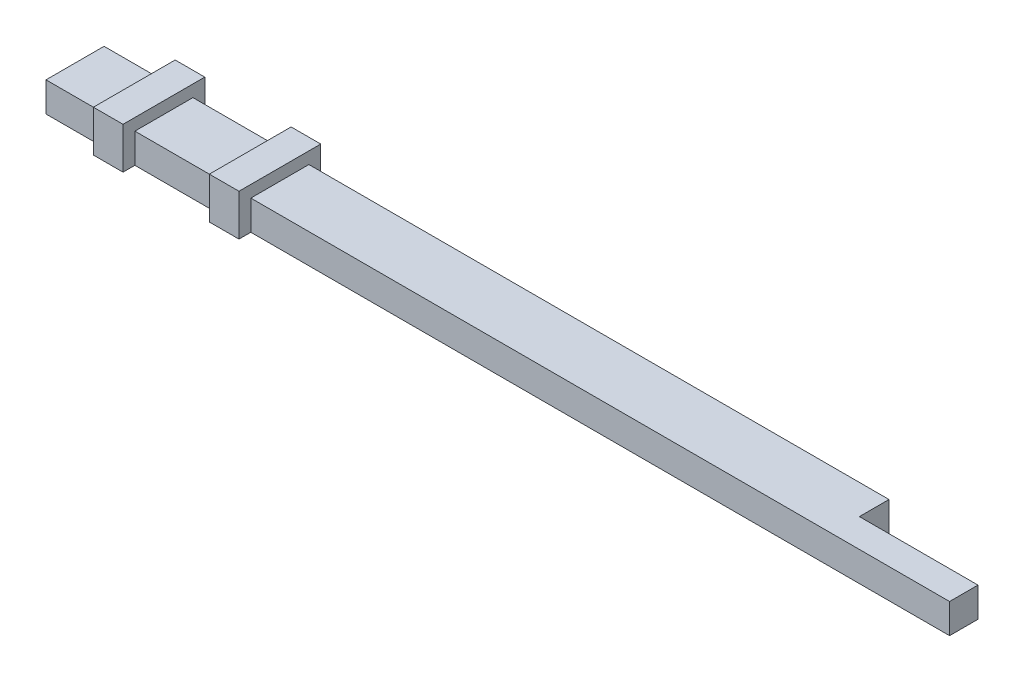
ISO-10303-21;
HEADER;
FILE_DESCRIPTION(('STEP AP214'),'2;1');
FILE_NAME('part.step','',(''),(''),'','','');
FILE_SCHEMA(('AUTOMOTIVE_DESIGN { 1 0 10303 214 1 1 1 1 }'));
ENDSEC;
DATA;
#1=APPLICATION_CONTEXT('core data for automotive mechanical design processes');
#2=APPLICATION_PROTOCOL_DEFINITION('international standard','automotive_design',2000,#1);
#3=PRODUCT_CONTEXT('',#1,'mechanical');
#4=PRODUCT('Part','Part','',(#3));
#5=PRODUCT_RELATED_PRODUCT_CATEGORY('part','',(#4));
#6=PRODUCT_DEFINITION_FORMATION('','',#4);
#7=PRODUCT_DEFINITION_CONTEXT('part definition',#1,'design');
#8=PRODUCT_DEFINITION('design','',#6,#7);
#9=PRODUCT_DEFINITION_SHAPE('','',#8);
#10=(LENGTH_UNIT() NAMED_UNIT(*) SI_UNIT(.MILLI.,.METRE.));
#11=(NAMED_UNIT(*) PLANE_ANGLE_UNIT() SI_UNIT($,.RADIAN.));
#12=(NAMED_UNIT(*) SI_UNIT($,.STERADIAN.) SOLID_ANGLE_UNIT());
#13=UNCERTAINTY_MEASURE_WITH_UNIT(LENGTH_MEASURE(1.E-05),#10,'distance_accuracy_value','');
#14=(GEOMETRIC_REPRESENTATION_CONTEXT(3) GLOBAL_UNCERTAINTY_ASSIGNED_CONTEXT((#13)) GLOBAL_UNIT_ASSIGNED_CONTEXT((#10,
#11,#12)) REPRESENTATION_CONTEXT('',''));
#15=CARTESIAN_POINT('',(0.,0.,0.));
#16=DIRECTION('',(0.,0.,1.));
#17=DIRECTION('',(1.,0.,0.));
#18=AXIS2_PLACEMENT_3D('',#15,#16,#17);
#19=CARTESIAN_POINT('',(142.5,5.,0.));
#20=DIRECTION('',(0.,0.,-1.));
#21=DIRECTION('',(-1.,0.,0.));
#22=AXIS2_PLACEMENT_3D('',#19,#20,#21);
#23=PLANE('',#22);
#24=DIRECTION('',(0.,-1.,0.));
#25=VECTOR('',#24,1.);
#26=CARTESIAN_POINT('',(29.57,5.,0.));
#27=LINE('',#26,#25);
#28=CARTESIAN_POINT('',(29.57,5.,0.));
#29=VERTEX_POINT('',#28);
#30=CARTESIAN_POINT('',(29.57,0.,0.));
#31=VERTEX_POINT('',#30);
#32=EDGE_CURVE('E218',#29,#31,#27,.T.);
#33=ORIENTED_EDGE('',*,*,#32,.F.);
#34=DIRECTION('',(1.,0.,0.));
#35=VECTOR('',#34,1.);
#36=CARTESIAN_POINT('',(0.,5.,0.));
#37=LINE('',#36,#35);
#38=CARTESIAN_POINT('',(15.,5.,0.));
#39=VERTEX_POINT('',#38);
#40=EDGE_CURVE('E351',#39,#29,#37,.T.);
#41=ORIENTED_EDGE('',*,*,#40,.F.);
#42=DIRECTION('',(0.,1.,0.));
#43=VECTOR('',#42,1.);
#44=CARTESIAN_POINT('',(15.,5.,0.));
#45=LINE('',#44,#43);
#46=CARTESIAN_POINT('',(15.,0.,0.));
#47=VERTEX_POINT('',#46);
#48=EDGE_CURVE('E336',#47,#39,#45,.T.);
#49=ORIENTED_EDGE('',*,*,#48,.F.);
#50=DIRECTION('',(1.,0.,0.));
#51=VECTOR('',#50,1.);
#52=CARTESIAN_POINT('',(142.5,0.,0.));
#53=LINE('',#52,#51);
#54=EDGE_CURVE('E376',#47,#31,#53,.T.);
#55=ORIENTED_EDGE('',*,*,#54,.T.);
#56=EDGE_LOOP('',(#33,#41,#49,#55));
#57=FACE_BOUND('',#56,.T.);
#58=ADVANCED_FACE('F45',(#57),#23,.F.);
#59=CARTESIAN_POINT('',(0.,5.,-9.8));
#60=DIRECTION('',(0.,0.,1.));
#61=DIRECTION('',(1.,0.,0.));
#62=AXIS2_PLACEMENT_3D('',#59,#60,#61);
#63=PLANE('',#62);
#64=DIRECTION('',(0.,1.,0.));
#65=VECTOR('',#64,1.);
#66=CARTESIAN_POINT('',(29.57,5.,-9.8));
#67=LINE('',#66,#65);
#68=CARTESIAN_POINT('',(29.57,0.,-9.8));
#69=VERTEX_POINT('',#68);
#70=CARTESIAN_POINT('',(29.57,5.,-9.8));
#71=VERTEX_POINT('',#70);
#72=EDGE_CURVE('E268',#69,#71,#67,.T.);
#73=ORIENTED_EDGE('',*,*,#72,.F.);
#74=DIRECTION('',(-1.,0.,0.));
#75=VECTOR('',#74,1.);
#76=CARTESIAN_POINT('',(0.,0.,-9.8));
#77=LINE('',#76,#75);
#78=CARTESIAN_POINT('',(15.,0.,-9.8));
#79=VERTEX_POINT('',#78);
#80=EDGE_CURVE('E390',#69,#79,#77,.T.);
#81=ORIENTED_EDGE('',*,*,#80,.T.);
#82=DIRECTION('',(0.,-1.,0.));
#83=VECTOR('',#82,1.);
#84=CARTESIAN_POINT('',(15.,5.,-9.8));
#85=LINE('',#84,#83);
#86=CARTESIAN_POINT('',(15.,5.,-9.8));
#87=VERTEX_POINT('',#86);
#88=EDGE_CURVE('E332',#87,#79,#85,.T.);
#89=ORIENTED_EDGE('',*,*,#88,.F.);
#90=DIRECTION('',(-1.,0.,0.));
#91=VECTOR('',#90,1.);
#92=CARTESIAN_POINT('',(0.,5.,-9.8));
#93=LINE('',#92,#91);
#94=EDGE_CURVE('E366',#71,#87,#93,.T.);
#95=ORIENTED_EDGE('',*,*,#94,.F.);
#96=EDGE_LOOP('',(#73,#81,#89,#95));
#97=FACE_BOUND('',#96,.T.);
#98=ADVANCED_FACE('F452',(#97),#63,.F.);
#99=CARTESIAN_POINT('',(0.,5.,0.));
#100=DIRECTION('',(0.,-1.,0.));
#101=DIRECTION('',(0.,0.,-1.));
#102=AXIS2_PLACEMENT_3D('',#99,#100,#101);
#103=PLANE('',#102);
#104=DIRECTION('',(0.,0.,1.));
#105=VECTOR('',#104,1.);
#106=CARTESIAN_POINT('',(29.57,5.,0.));
#107=LINE('',#106,#105);
#108=EDGE_CURVE('E265',#71,#29,#107,.T.);
#109=ORIENTED_EDGE('',*,*,#108,.F.);
#110=ORIENTED_EDGE('',*,*,#94,.T.);
#111=DIRECTION('',(0.,0.,-1.));
#112=VECTOR('',#111,1.);
#113=CARTESIAN_POINT('',(15.,5.,0.));
#114=LINE('',#113,#112);
#115=EDGE_CURVE('E328',#39,#87,#114,.T.);
#116=ORIENTED_EDGE('',*,*,#115,.F.);
#117=ORIENTED_EDGE('',*,*,#40,.T.);
#118=EDGE_LOOP('',(#109,#110,#116,#117));
#119=FACE_BOUND('',#118,.T.);
#120=ADVANCED_FACE('F435',(#119),#103,.F.);
#121=CARTESIAN_POINT('',(34.57,5.,0.));
#122=VERTEX_POINT('',#121);
#123=CARTESIAN_POINT('',(152.5,5.,0.));
#124=VERTEX_POINT('',#123);
#125=EDGE_CURVE('E344',#122,#124,#37,.T.);
#126=ORIENTED_EDGE('',*,*,#125,.F.);
#127=DIRECTION('',(0.,-1.,0.));
#128=VECTOR('',#127,1.);
#129=CARTESIAN_POINT('',(34.57,5.,0.));
#130=LINE('',#129,#128);
#131=CARTESIAN_POINT('',(34.57,0.,0.));
#132=VERTEX_POINT('',#131);
#133=EDGE_CURVE('E61',#122,#132,#130,.T.);
#134=ORIENTED_EDGE('',*,*,#133,.T.);
#135=CARTESIAN_POINT('',(152.5,0.,0.));
#136=VERTEX_POINT('',#135);
#137=EDGE_CURVE('E370',#132,#136,#53,.T.);
#138=ORIENTED_EDGE('',*,*,#137,.T.);
#139=DIRECTION('',(0.,-1.,0.));
#140=VECTOR('',#139,1.);
#141=CARTESIAN_POINT('',(152.5,5.,0.));
#142=LINE('',#141,#140);
#143=EDGE_CURVE('E54',#124,#136,#142,.T.);
#144=ORIENTED_EDGE('',*,*,#143,.F.);
#145=EDGE_LOOP('',(#126,#134,#138,#144));
#146=FACE_BOUND('',#145,.T.);
#147=ADVANCED_FACE('F441',(#146),#23,.F.);
#148=CARTESIAN_POINT('',(132.481495241722,0.,-9.8));
#149=VERTEX_POINT('',#148);
#150=CARTESIAN_POINT('',(34.57,0.,-9.8));
#151=VERTEX_POINT('',#150);
#152=EDGE_CURVE('E345',#149,#151,#77,.T.);
#153=ORIENTED_EDGE('',*,*,#152,.T.);
#154=DIRECTION('',(0.,1.,0.));
#155=VECTOR('',#154,1.);
#156=CARTESIAN_POINT('',(34.57,5.,-9.8));
#157=LINE('',#156,#155);
#158=CARTESIAN_POINT('',(34.57,5.,-9.8));
#159=VERTEX_POINT('',#158);
#160=EDGE_CURVE('E259',#151,#159,#157,.T.);
#161=ORIENTED_EDGE('',*,*,#160,.T.);
#162=CARTESIAN_POINT('',(132.481495241722,5.,-9.8));
#163=VERTEX_POINT('',#162);
#164=EDGE_CURVE('E361',#163,#159,#93,.T.);
#165=ORIENTED_EDGE('',*,*,#164,.F.);
#166=DIRECTION('',(0.,-1.,0.));
#167=VECTOR('',#166,1.);
#168=CARTESIAN_POINT('',(132.481495241722,5.,-9.8));
#169=LINE('',#168,#167);
#170=EDGE_CURVE('E394',#163,#149,#169,.T.);
#171=ORIENTED_EDGE('',*,*,#170,.T.);
#172=EDGE_LOOP('',(#153,#161,#165,#171));
#173=FACE_BOUND('',#172,.T.);
#174=ADVANCED_FACE('F443',(#173),#63,.F.);
#175=ORIENTED_EDGE('',*,*,#164,.T.);
#176=DIRECTION('',(0.,0.,1.));
#177=VECTOR('',#176,1.);
#178=CARTESIAN_POINT('',(34.57,5.,0.));
#179=LINE('',#178,#177);
#180=EDGE_CURVE('E250',#159,#122,#179,.T.);
#181=ORIENTED_EDGE('',*,*,#180,.T.);
#182=ORIENTED_EDGE('',*,*,#125,.T.);
#183=DIRECTION('',(0.,0.,-1.));
#184=VECTOR('',#183,1.);
#185=CARTESIAN_POINT('',(152.5,5.,0.));
#186=LINE('',#185,#184);
#187=CARTESIAN_POINT('',(152.5,5.,-4.8));
#188=VERTEX_POINT('',#187);
#189=EDGE_CURVE('E350',#124,#188,#186,.T.);
#190=ORIENTED_EDGE('',*,*,#189,.T.);
#191=DIRECTION('',(-1.,0.,0.));
#192=VECTOR('',#191,1.);
#193=CARTESIAN_POINT('',(142.481495241722,5.,-4.8));
#194=LINE('',#193,#192);
#195=CARTESIAN_POINT('',(132.481495241722,5.,-4.8));
#196=VERTEX_POINT('',#195);
#197=EDGE_CURVE('E354',#188,#196,#194,.T.);
#198=ORIENTED_EDGE('',*,*,#197,.T.);
#199=DIRECTION('',(0.,0.,-1.));
#200=VECTOR('',#199,1.);
#201=CARTESIAN_POINT('',(132.481495241722,5.,-9.8));
#202=LINE('',#201,#200);
#203=EDGE_CURVE('E357',#196,#163,#202,.T.);
#204=ORIENTED_EDGE('',*,*,#203,.T.);
#205=EDGE_LOOP('',(#175,#181,#182,#190,#198,#204));
#206=FACE_BOUND('',#205,.T.);
#207=ADVANCED_FACE('F427',(#206),#103,.F.);
#208=CARTESIAN_POINT('',(0.,5.,0.));
#209=DIRECTION('',(1.,0.,0.));
#210=DIRECTION('',(0.,0.,-1.));
#211=AXIS2_PLACEMENT_3D('',#208,#209,#210);
#212=PLANE('',#211);
#213=DIRECTION('',(0.,0.,1.));
#214=VECTOR('',#213,1.);
#215=CARTESIAN_POINT('',(0.,0.,0.));
#216=LINE('',#215,#214);
#217=CARTESIAN_POINT('',(0.,0.,-9.8));
#218=VERTEX_POINT('',#217);
#219=CARTESIAN_POINT('',(0.,0.,0.));
#220=VERTEX_POINT('',#219);
#221=EDGE_CURVE('E339',#218,#220,#216,.T.);
#222=ORIENTED_EDGE('',*,*,#221,.T.);
#223=DIRECTION('',(0.,-1.,0.));
#224=VECTOR('',#223,1.);
#225=CARTESIAN_POINT('',(0.,5.,0.));
#226=LINE('',#225,#224);
#227=CARTESIAN_POINT('',(0.,5.,0.));
#228=VERTEX_POINT('',#227);
#229=EDGE_CURVE('E11',#228,#220,#226,.T.);
#230=ORIENTED_EDGE('',*,*,#229,.F.);
#231=DIRECTION('',(0.,0.,1.));
#232=VECTOR('',#231,1.);
#233=CARTESIAN_POINT('',(0.,5.,0.));
#234=LINE('',#233,#232);
#235=CARTESIAN_POINT('',(0.,5.,-9.8));
#236=VERTEX_POINT('',#235);
#237=EDGE_CURVE('E340',#236,#228,#234,.T.);
#238=ORIENTED_EDGE('',*,*,#237,.F.);
#239=DIRECTION('',(0.,-1.,0.));
#240=VECTOR('',#239,1.);
#241=CARTESIAN_POINT('',(0.,5.,-9.8));
#242=LINE('',#241,#240);
#243=EDGE_CURVE('E365',#236,#218,#242,.T.);
#244=ORIENTED_EDGE('',*,*,#243,.T.);
#245=EDGE_LOOP('',(#222,#230,#238,#244));
#246=FACE_BOUND('',#245,.T.);
#247=ADVANCED_FACE('F47',(#246),#212,.F.);
#248=CARTESIAN_POINT('',(10.,0.,0.));
#249=VERTEX_POINT('',#248);
#250=EDGE_CURVE('E371',#220,#249,#53,.T.);
#251=ORIENTED_EDGE('',*,*,#250,.T.);
#252=DIRECTION('',(0.,1.,0.));
#253=VECTOR('',#252,1.);
#254=CARTESIAN_POINT('',(10.,5.,0.));
#255=LINE('',#254,#253);
#256=CARTESIAN_POINT('',(10.,5.,0.));
#257=VERTEX_POINT('',#256);
#258=EDGE_CURVE('E324',#249,#257,#255,.T.);
#259=ORIENTED_EDGE('',*,*,#258,.T.);
#260=EDGE_CURVE('E346',#228,#257,#37,.T.);
#261=ORIENTED_EDGE('',*,*,#260,.F.);
#262=ORIENTED_EDGE('',*,*,#229,.T.);
#263=EDGE_LOOP('',(#251,#259,#261,#262));
#264=FACE_BOUND('',#263,.T.);
#265=ADVANCED_FACE('F444',(#264),#23,.F.);
#266=CARTESIAN_POINT('',(152.5,5.,0.));
#267=DIRECTION('',(-1.,0.,0.));
#268=DIRECTION('',(0.,0.,1.));
#269=AXIS2_PLACEMENT_3D('',#266,#267,#268);
#270=PLANE('',#269);
#271=DIRECTION('',(0.,0.,-1.));
#272=VECTOR('',#271,1.);
#273=CARTESIAN_POINT('',(152.5,0.,0.));
#274=LINE('',#273,#272);
#275=CARTESIAN_POINT('',(152.5,0.,-4.8));
#276=VERTEX_POINT('',#275);
#277=EDGE_CURVE('E375',#136,#276,#274,.T.);
#278=ORIENTED_EDGE('',*,*,#277,.T.);
#279=DIRECTION('',(0.,-1.,0.));
#280=VECTOR('',#279,1.);
#281=CARTESIAN_POINT('',(152.5,5.,-4.8));
#282=LINE('',#281,#280);
#283=EDGE_CURVE('E402',#188,#276,#282,.T.);
#284=ORIENTED_EDGE('',*,*,#283,.F.);
#285=ORIENTED_EDGE('',*,*,#189,.F.);
#286=ORIENTED_EDGE('',*,*,#143,.T.);
#287=EDGE_LOOP('',(#278,#284,#285,#286));
#288=FACE_BOUND('',#287,.T.);
#289=ADVANCED_FACE('F411',(#288),#270,.F.);
#290=CARTESIAN_POINT('',(132.481495241722,5.,-4.8));
#291=DIRECTION('',(0.,0.,1.));
#292=DIRECTION('',(1.,0.,0.));
#293=AXIS2_PLACEMENT_3D('',#290,#291,#292);
#294=PLANE('',#293);
#295=DIRECTION('',(-1.,0.,0.));
#296=VECTOR('',#295,1.);
#297=CARTESIAN_POINT('',(132.481495241722,0.,-4.8));
#298=LINE('',#297,#296);
#299=CARTESIAN_POINT('',(132.481495241722,0.,-4.8));
#300=VERTEX_POINT('',#299);
#301=EDGE_CURVE('E380',#276,#300,#298,.T.);
#302=ORIENTED_EDGE('',*,*,#301,.T.);
#303=DIRECTION('',(0.,-1.,0.));
#304=VECTOR('',#303,1.);
#305=CARTESIAN_POINT('',(132.481495241722,5.,-4.8));
#306=LINE('',#305,#304);
#307=EDGE_CURVE('E398',#196,#300,#306,.T.);
#308=ORIENTED_EDGE('',*,*,#307,.F.);
#309=ORIENTED_EDGE('',*,*,#197,.F.);
#310=ORIENTED_EDGE('',*,*,#283,.T.);
#311=EDGE_LOOP('',(#302,#308,#309,#310));
#312=FACE_BOUND('',#311,.T.);
#313=ADVANCED_FACE('F419',(#312),#294,.F.);
#314=CARTESIAN_POINT('',(132.481495241722,5.,-9.8));
#315=DIRECTION('',(-1.,0.,0.));
#316=DIRECTION('',(0.,0.,1.));
#317=AXIS2_PLACEMENT_3D('',#314,#315,#316);
#318=PLANE('',#317);
#319=DIRECTION('',(0.,0.,-1.));
#320=VECTOR('',#319,1.);
#321=CARTESIAN_POINT('',(132.481495241722,0.,-9.8));
#322=LINE('',#321,#320);
#323=EDGE_CURVE('E383',#300,#149,#322,.T.);
#324=ORIENTED_EDGE('',*,*,#323,.T.);
#325=ORIENTED_EDGE('',*,*,#170,.F.);
#326=ORIENTED_EDGE('',*,*,#203,.F.);
#327=ORIENTED_EDGE('',*,*,#307,.T.);
#328=EDGE_LOOP('',(#324,#325,#326,#327));
#329=FACE_BOUND('',#328,.T.);
#330=ADVANCED_FACE('F423',(#329),#318,.F.);
#331=CARTESIAN_POINT('',(10.,5.,-9.8));
#332=VERTEX_POINT('',#331);
#333=EDGE_CURVE('E360',#332,#236,#93,.T.);
#334=ORIENTED_EDGE('',*,*,#333,.F.);
#335=DIRECTION('',(0.,-1.,0.));
#336=VECTOR('',#335,1.);
#337=CARTESIAN_POINT('',(10.,5.,-9.8));
#338=LINE('',#337,#336);
#339=CARTESIAN_POINT('',(10.,0.,-9.8));
#340=VERTEX_POINT('',#339);
#341=EDGE_CURVE('E69',#332,#340,#338,.T.);
#342=ORIENTED_EDGE('',*,*,#341,.T.);
#343=EDGE_CURVE('E386',#340,#218,#77,.T.);
#344=ORIENTED_EDGE('',*,*,#343,.T.);
#345=ORIENTED_EDGE('',*,*,#243,.F.);
#346=EDGE_LOOP('',(#334,#342,#344,#345));
#347=FACE_BOUND('',#346,.T.);
#348=ADVANCED_FACE('F451',(#347),#63,.F.);
#349=ORIENTED_EDGE('',*,*,#260,.T.);
#350=DIRECTION('',(0.,0.,-1.));
#351=VECTOR('',#350,1.);
#352=CARTESIAN_POINT('',(10.,5.,0.));
#353=LINE('',#352,#351);
#354=EDGE_CURVE('E310',#257,#332,#353,.T.);
#355=ORIENTED_EDGE('',*,*,#354,.T.);
#356=ORIENTED_EDGE('',*,*,#333,.T.);
#357=ORIENTED_EDGE('',*,*,#237,.T.);
#358=EDGE_LOOP('',(#349,#355,#356,#357));
#359=FACE_BOUND('',#358,.T.);
#360=ADVANCED_FACE('F454',(#359),#103,.F.);
#361=CARTESIAN_POINT('',(0.,0.,0.));
#362=DIRECTION('',(0.,-1.,0.));
#363=DIRECTION('',(0.,0.,-1.));
#364=AXIS2_PLACEMENT_3D('',#361,#362,#363);
#365=PLANE('',#364);
#366=ORIENTED_EDGE('',*,*,#137,.F.);
#367=DIRECTION('',(0.,0.,-1.));
#368=VECTOR('',#367,1.);
#369=CARTESIAN_POINT('',(34.57,0.,2.));
#370=LINE('',#369,#368);
#371=CARTESIAN_POINT('',(34.57,0.,2.));
#372=VERTEX_POINT('',#371);
#373=EDGE_CURVE('E202',#372,#132,#370,.T.);
#374=ORIENTED_EDGE('',*,*,#373,.F.);
#375=DIRECTION('',(1.,0.,0.));
#376=VECTOR('',#375,1.);
#377=CARTESIAN_POINT('',(29.57,0.,2.));
#378=LINE('',#377,#376);
#379=CARTESIAN_POINT('',(29.57,0.,2.));
#380=VERTEX_POINT('',#379);
#381=EDGE_CURVE('E195',#380,#372,#378,.T.);
#382=ORIENTED_EDGE('',*,*,#381,.F.);
#383=DIRECTION('',(0.,0.,-1.));
#384=VECTOR('',#383,1.);
#385=CARTESIAN_POINT('',(29.57,0.,2.));
#386=LINE('',#385,#384);
#387=EDGE_CURVE('E200',#380,#31,#386,.T.);
#388=ORIENTED_EDGE('',*,*,#387,.T.);
#389=ORIENTED_EDGE('',*,*,#54,.F.);
#390=DIRECTION('',(0.,0.,1.));
#391=VECTOR('',#390,1.);
#392=CARTESIAN_POINT('',(15.,0.,-11.8));
#393=LINE('',#392,#391);
#394=CARTESIAN_POINT('',(15.,0.,2.));
#395=VERTEX_POINT('',#394);
#396=EDGE_CURVE('E278',#47,#395,#393,.T.);
#397=ORIENTED_EDGE('',*,*,#396,.T.);
#398=DIRECTION('',(-1.,0.,0.));
#399=VECTOR('',#398,1.);
#400=CARTESIAN_POINT('',(15.,0.,2.));
#401=LINE('',#400,#399);
#402=CARTESIAN_POINT('',(10.,0.,2.));
#403=VERTEX_POINT('',#402);
#404=EDGE_CURVE('E314',#395,#403,#401,.T.);
#405=ORIENTED_EDGE('',*,*,#404,.T.);
#406=DIRECTION('',(0.,0.,1.));
#407=VECTOR('',#406,1.);
#408=CARTESIAN_POINT('',(10.,0.,-11.8));
#409=LINE('',#408,#407);
#410=EDGE_CURVE('E296',#249,#403,#409,.T.);
#411=ORIENTED_EDGE('',*,*,#410,.F.);
#412=ORIENTED_EDGE('',*,*,#250,.F.);
#413=ORIENTED_EDGE('',*,*,#221,.F.);
#414=ORIENTED_EDGE('',*,*,#343,.F.);
#415=CARTESIAN_POINT('',(10.,0.,-11.8));
#416=VERTEX_POINT('',#415);
#417=EDGE_CURVE('E297',#416,#340,#409,.T.);
#418=ORIENTED_EDGE('',*,*,#417,.F.);
#419=DIRECTION('',(-1.,0.,0.));
#420=VECTOR('',#419,1.);
#421=CARTESIAN_POINT('',(15.,0.,-11.8));
#422=LINE('',#421,#420);
#423=CARTESIAN_POINT('',(15.,0.,-11.8));
#424=VERTEX_POINT('',#423);
#425=EDGE_CURVE('E292',#424,#416,#422,.T.);
#426=ORIENTED_EDGE('',*,*,#425,.F.);
#427=EDGE_CURVE('E280',#424,#79,#393,.T.);
#428=ORIENTED_EDGE('',*,*,#427,.T.);
#429=ORIENTED_EDGE('',*,*,#80,.F.);
#430=CARTESIAN_POINT('',(29.57,0.,-11.8));
#431=VERTEX_POINT('',#430);
#432=EDGE_CURVE('E221',#69,#431,#386,.T.);
#433=ORIENTED_EDGE('',*,*,#432,.T.);
#434=DIRECTION('',(1.,0.,0.));
#435=VECTOR('',#434,1.);
#436=CARTESIAN_POINT('',(29.57,0.,-11.8));
#437=LINE('',#436,#435);
#438=CARTESIAN_POINT('',(34.57,0.,-11.8));
#439=VERTEX_POINT('',#438);
#440=EDGE_CURVE('E208',#431,#439,#437,.T.);
#441=ORIENTED_EDGE('',*,*,#440,.T.);
#442=EDGE_CURVE('E242',#151,#439,#370,.T.);
#443=ORIENTED_EDGE('',*,*,#442,.F.);
#444=ORIENTED_EDGE('',*,*,#152,.F.);
#445=ORIENTED_EDGE('',*,*,#323,.F.);
#446=ORIENTED_EDGE('',*,*,#301,.F.);
#447=ORIENTED_EDGE('',*,*,#277,.F.);
#448=EDGE_LOOP('',(#366,#374,#382,#388,#389,#397,#405,#411,#412,#413,#414,#418,#426,#428,#429,
#433,#441,#443,#444,#445,#446,#447));
#449=FACE_BOUND('',#448,.T.);
#450=ADVANCED_FACE('F198',(#449),#365,.T.);
#451=CARTESIAN_POINT('',(15.,0.,0.));
#452=DIRECTION('',(-1.,0.,0.));
#453=DIRECTION('',(0.,0.,1.));
#454=AXIS2_PLACEMENT_3D('',#451,#452,#453);
#455=PLANE('',#454);
#456=ORIENTED_EDGE('',*,*,#396,.F.);
#457=ORIENTED_EDGE('',*,*,#48,.T.);
#458=ORIENTED_EDGE('',*,*,#115,.T.);
#459=ORIENTED_EDGE('',*,*,#88,.T.);
#460=ORIENTED_EDGE('',*,*,#427,.F.);
#461=DIRECTION('',(0.,-1.,0.));
#462=VECTOR('',#461,1.);
#463=CARTESIAN_POINT('',(15.,7.,-11.8));
#464=LINE('',#463,#462);
#465=CARTESIAN_POINT('',(15.,7.,-11.8));
#466=VERTEX_POINT('',#465);
#467=EDGE_CURVE('E274',#466,#424,#464,.T.);
#468=ORIENTED_EDGE('',*,*,#467,.F.);
#469=DIRECTION('',(0.,0.,-1.));
#470=VECTOR('',#469,1.);
#471=CARTESIAN_POINT('',(15.,7.,-11.8));
#472=LINE('',#471,#470);
#473=CARTESIAN_POINT('',(15.,7.,2.));
#474=VERTEX_POINT('',#473);
#475=EDGE_CURVE('E288',#474,#466,#472,.T.);
#476=ORIENTED_EDGE('',*,*,#475,.F.);
#477=DIRECTION('',(0.,1.,0.));
#478=VECTOR('',#477,1.);
#479=CARTESIAN_POINT('',(15.,7.,2.));
#480=LINE('',#479,#478);
#481=EDGE_CURVE('E284',#395,#474,#480,.T.);
#482=ORIENTED_EDGE('',*,*,#481,.F.);
#483=EDGE_LOOP('',(#456,#457,#458,#459,#460,#468,#476,#482));
#484=FACE_BOUND('',#483,.T.);
#485=ADVANCED_FACE('F484',(#484),#455,.F.);
#486=CARTESIAN_POINT('',(10.,0.,0.));
#487=DIRECTION('',(-1.,0.,0.));
#488=DIRECTION('',(0.,0.,1.));
#489=AXIS2_PLACEMENT_3D('',#486,#487,#488);
#490=PLANE('',#489);
#491=ORIENTED_EDGE('',*,*,#258,.F.);
#492=ORIENTED_EDGE('',*,*,#410,.T.);
#493=DIRECTION('',(0.,1.,0.));
#494=VECTOR('',#493,1.);
#495=CARTESIAN_POINT('',(10.,7.,2.));
#496=LINE('',#495,#494);
#497=CARTESIAN_POINT('',(10.,7.,2.));
#498=VERTEX_POINT('',#497);
#499=EDGE_CURVE('E300',#403,#498,#496,.T.);
#500=ORIENTED_EDGE('',*,*,#499,.T.);
#501=DIRECTION('',(0.,0.,-1.));
#502=VECTOR('',#501,1.);
#503=CARTESIAN_POINT('',(10.,7.,-11.8));
#504=LINE('',#503,#502);
#505=CARTESIAN_POINT('',(10.,7.,-11.8));
#506=VERTEX_POINT('',#505);
#507=EDGE_CURVE('E279',#498,#506,#504,.T.);
#508=ORIENTED_EDGE('',*,*,#507,.T.);
#509=DIRECTION('',(0.,-1.,0.));
#510=VECTOR('',#509,1.);
#511=CARTESIAN_POINT('',(10.,7.,-11.8));
#512=LINE('',#511,#510);
#513=EDGE_CURVE('E273',#506,#416,#512,.T.);
#514=ORIENTED_EDGE('',*,*,#513,.T.);
#515=ORIENTED_EDGE('',*,*,#417,.T.);
#516=ORIENTED_EDGE('',*,*,#341,.F.);
#517=ORIENTED_EDGE('',*,*,#354,.F.);
#518=EDGE_LOOP('',(#491,#492,#500,#508,#514,#515,#516,#517));
#519=FACE_BOUND('',#518,.T.);
#520=ADVANCED_FACE('F494',(#519),#490,.T.);
#521=CARTESIAN_POINT('',(15.,7.,-11.8));
#522=DIRECTION('',(0.,0.,-1.));
#523=DIRECTION('',(-1.,0.,0.));
#524=AXIS2_PLACEMENT_3D('',#521,#522,#523);
#525=PLANE('',#524);
#526=ORIENTED_EDGE('',*,*,#513,.F.);
#527=DIRECTION('',(-1.,0.,0.));
#528=VECTOR('',#527,1.);
#529=CARTESIAN_POINT('',(15.,7.,-11.8));
#530=LINE('',#529,#528);
#531=EDGE_CURVE('E307',#466,#506,#530,.T.);
#532=ORIENTED_EDGE('',*,*,#531,.F.);
#533=ORIENTED_EDGE('',*,*,#467,.T.);
#534=ORIENTED_EDGE('',*,*,#425,.T.);
#535=EDGE_LOOP('',(#526,#532,#533,#534));
#536=FACE_BOUND('',#535,.T.);
#537=ADVANCED_FACE('F507',(#536),#525,.T.);
#538=CARTESIAN_POINT('',(15.,7.,-11.8));
#539=DIRECTION('',(0.,1.,0.));
#540=DIRECTION('',(0.,0.,1.));
#541=AXIS2_PLACEMENT_3D('',#538,#539,#540);
#542=PLANE('',#541);
#543=ORIENTED_EDGE('',*,*,#507,.F.);
#544=DIRECTION('',(-1.,0.,0.));
#545=VECTOR('',#544,1.);
#546=CARTESIAN_POINT('',(15.,7.,2.));
#547=LINE('',#546,#545);
#548=EDGE_CURVE('E311',#474,#498,#547,.T.);
#549=ORIENTED_EDGE('',*,*,#548,.F.);
#550=ORIENTED_EDGE('',*,*,#475,.T.);
#551=ORIENTED_EDGE('',*,*,#531,.T.);
#552=EDGE_LOOP('',(#543,#549,#550,#551));
#553=FACE_BOUND('',#552,.T.);
#554=ADVANCED_FACE('F504',(#553),#542,.T.);
#555=CARTESIAN_POINT('',(15.,7.,2.));
#556=DIRECTION('',(0.,0.,1.));
#557=DIRECTION('',(1.,0.,0.));
#558=AXIS2_PLACEMENT_3D('',#555,#556,#557);
#559=PLANE('',#558);
#560=ORIENTED_EDGE('',*,*,#499,.F.);
#561=ORIENTED_EDGE('',*,*,#404,.F.);
#562=ORIENTED_EDGE('',*,*,#481,.T.);
#563=ORIENTED_EDGE('',*,*,#548,.T.);
#564=EDGE_LOOP('',(#560,#561,#562,#563));
#565=FACE_BOUND('',#564,.T.);
#566=ADVANCED_FACE('F501',(#565),#559,.T.);
#567=CARTESIAN_POINT('',(29.57,0.,0.));
#568=DIRECTION('',(1.,0.,0.));
#569=DIRECTION('',(0.,0.,-1.));
#570=AXIS2_PLACEMENT_3D('',#567,#568,#569);
#571=PLANE('',#570);
#572=ORIENTED_EDGE('',*,*,#108,.T.);
#573=ORIENTED_EDGE('',*,*,#32,.T.);
#574=ORIENTED_EDGE('',*,*,#387,.F.);
#575=DIRECTION('',(0.,-1.,0.));
#576=VECTOR('',#575,1.);
#577=CARTESIAN_POINT('',(29.57,7.,2.));
#578=LINE('',#577,#576);
#579=CARTESIAN_POINT('',(29.57,7.,2.));
#580=VERTEX_POINT('',#579);
#581=EDGE_CURVE('E215',#580,#380,#578,.T.);
#582=ORIENTED_EDGE('',*,*,#581,.F.);
#583=DIRECTION('',(0.,0.,1.));
#584=VECTOR('',#583,1.);
#585=CARTESIAN_POINT('',(29.57,7.,2.));
#586=LINE('',#585,#584);
#587=CARTESIAN_POINT('',(29.57,7.,-11.8));
#588=VERTEX_POINT('',#587);
#589=EDGE_CURVE('E209',#588,#580,#586,.T.);
#590=ORIENTED_EDGE('',*,*,#589,.F.);
#591=DIRECTION('',(0.,1.,0.));
#592=VECTOR('',#591,1.);
#593=CARTESIAN_POINT('',(29.57,7.,-11.8));
#594=LINE('',#593,#592);
#595=EDGE_CURVE('E220',#431,#588,#594,.T.);
#596=ORIENTED_EDGE('',*,*,#595,.F.);
#597=ORIENTED_EDGE('',*,*,#432,.F.);
#598=ORIENTED_EDGE('',*,*,#72,.T.);
#599=EDGE_LOOP('',(#572,#573,#574,#582,#590,#596,#597,#598));
#600=FACE_BOUND('',#599,.T.);
#601=ADVANCED_FACE('F213',(#600),#571,.F.);
#602=CARTESIAN_POINT('',(34.57,0.,0.));
#603=DIRECTION('',(1.,0.,0.));
#604=DIRECTION('',(0.,0.,-1.));
#605=AXIS2_PLACEMENT_3D('',#602,#603,#604);
#606=PLANE('',#605);
#607=ORIENTED_EDGE('',*,*,#133,.F.);
#608=ORIENTED_EDGE('',*,*,#180,.F.);
#609=ORIENTED_EDGE('',*,*,#160,.F.);
#610=ORIENTED_EDGE('',*,*,#442,.T.);
#611=DIRECTION('',(0.,1.,0.));
#612=VECTOR('',#611,1.);
#613=CARTESIAN_POINT('',(34.57,7.,-11.8));
#614=LINE('',#613,#612);
#615=CARTESIAN_POINT('',(34.57,7.,-11.8));
#616=VERTEX_POINT('',#615);
#617=EDGE_CURVE('E231',#439,#616,#614,.T.);
#618=ORIENTED_EDGE('',*,*,#617,.T.);
#619=DIRECTION('',(0.,0.,1.));
#620=VECTOR('',#619,1.);
#621=CARTESIAN_POINT('',(34.57,7.,2.));
#622=LINE('',#621,#620);
#623=CARTESIAN_POINT('',(34.57,7.,2.));
#624=VERTEX_POINT('',#623);
#625=EDGE_CURVE('E226',#616,#624,#622,.T.);
#626=ORIENTED_EDGE('',*,*,#625,.T.);
#627=DIRECTION('',(0.,-1.,0.));
#628=VECTOR('',#627,1.);
#629=CARTESIAN_POINT('',(34.57,7.,2.));
#630=LINE('',#629,#628);
#631=EDGE_CURVE('E239',#624,#372,#630,.T.);
#632=ORIENTED_EDGE('',*,*,#631,.T.);
#633=ORIENTED_EDGE('',*,*,#373,.T.);
#634=EDGE_LOOP('',(#607,#608,#609,#610,#618,#626,#632,#633));
#635=FACE_BOUND('',#634,.T.);
#636=ADVANCED_FACE('F532',(#635),#606,.T.);
#637=CARTESIAN_POINT('',(29.57,7.,2.));
#638=DIRECTION('',(0.,0.,1.));
#639=DIRECTION('',(0.,-1.,0.));
#640=AXIS2_PLACEMENT_3D('',#637,#638,#639);
#641=PLANE('',#640);
#642=ORIENTED_EDGE('',*,*,#631,.F.);
#643=DIRECTION('',(1.,0.,0.));
#644=VECTOR('',#643,1.);
#645=CARTESIAN_POINT('',(29.57,7.,2.));
#646=LINE('',#645,#644);
#647=EDGE_CURVE('E224',#580,#624,#646,.T.);
#648=ORIENTED_EDGE('',*,*,#647,.F.);
#649=ORIENTED_EDGE('',*,*,#581,.T.);
#650=ORIENTED_EDGE('',*,*,#381,.T.);
#651=EDGE_LOOP('',(#642,#648,#649,#650));
#652=FACE_BOUND('',#651,.T.);
#653=ADVANCED_FACE('F223',(#652),#641,.T.);
#654=CARTESIAN_POINT('',(29.57,7.,2.));
#655=DIRECTION('',(0.,1.,0.));
#656=DIRECTION('',(0.,0.,1.));
#657=AXIS2_PLACEMENT_3D('',#654,#655,#656);
#658=PLANE('',#657);
#659=ORIENTED_EDGE('',*,*,#625,.F.);
#660=DIRECTION('',(1.,0.,0.));
#661=VECTOR('',#660,1.);
#662=CARTESIAN_POINT('',(29.57,7.,-11.8));
#663=LINE('',#662,#661);
#664=EDGE_CURVE('E251',#588,#616,#663,.T.);
#665=ORIENTED_EDGE('',*,*,#664,.F.);
#666=ORIENTED_EDGE('',*,*,#589,.T.);
#667=ORIENTED_EDGE('',*,*,#647,.T.);
#668=EDGE_LOOP('',(#659,#665,#666,#667));
#669=FACE_BOUND('',#668,.T.);
#670=ADVANCED_FACE('F531',(#669),#658,.T.);
#671=CARTESIAN_POINT('',(29.57,7.,-11.8));
#672=DIRECTION('',(0.,0.,-1.));
#673=DIRECTION('',(-1.,0.,0.));
#674=AXIS2_PLACEMENT_3D('',#671,#672,#673);
#675=PLANE('',#674);
#676=ORIENTED_EDGE('',*,*,#617,.F.);
#677=ORIENTED_EDGE('',*,*,#440,.F.);
#678=ORIENTED_EDGE('',*,*,#595,.T.);
#679=ORIENTED_EDGE('',*,*,#664,.T.);
#680=EDGE_LOOP('',(#676,#677,#678,#679));
#681=FACE_BOUND('',#680,.T.);
#682=ADVANCED_FACE('F533',(#681),#675,.T.);
#683=CLOSED_SHELL('',(#58,#98,#120,#147,#174,#207,#247,#265,#289,#313,#330,#348,#360,#450,#485,
#520,#537,#554,#566,#601,#636,#653,#670,#682));
#684=MANIFOLD_SOLID_BREP('B2',#683);
#685=ADVANCED_BREP_SHAPE_REPRESENTATION('',(#18,#684),#14);
#686=SHAPE_DEFINITION_REPRESENTATION(#9,#685);
ENDSEC;
END-ISO-10303-21;
